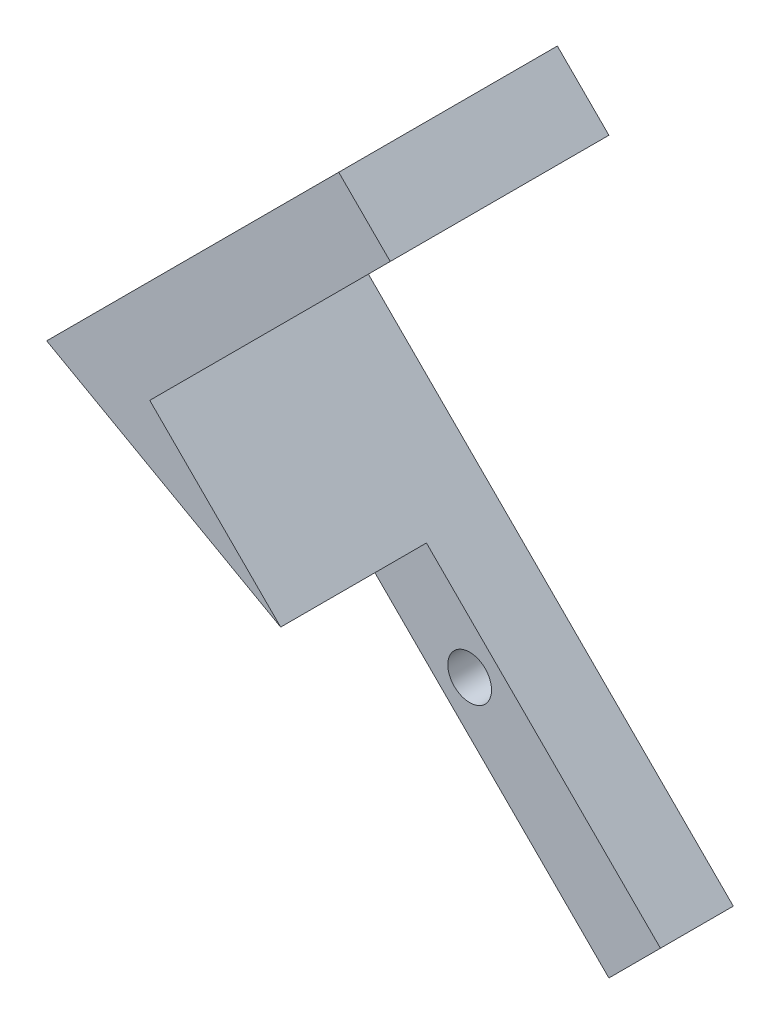
ISO-10303-21;
HEADER;
FILE_DESCRIPTION(('STEP AP214'),'2;1');
FILE_NAME('part.step','',(''),(''),'','','');
FILE_SCHEMA(('AUTOMOTIVE_DESIGN { 1 0 10303 214 1 1 1 1 }'));
ENDSEC;
DATA;
#1=APPLICATION_CONTEXT('core data for automotive mechanical design processes');
#2=APPLICATION_PROTOCOL_DEFINITION('international standard','automotive_design',2000,#1);
#3=PRODUCT_CONTEXT('',#1,'mechanical');
#4=PRODUCT('Part','Part','',(#3));
#5=PRODUCT_RELATED_PRODUCT_CATEGORY('part','',(#4));
#6=PRODUCT_DEFINITION_FORMATION('','',#4);
#7=PRODUCT_DEFINITION_CONTEXT('part definition',#1,'design');
#8=PRODUCT_DEFINITION('design','',#6,#7);
#9=PRODUCT_DEFINITION_SHAPE('','',#8);
#10=(LENGTH_UNIT() NAMED_UNIT(*) SI_UNIT(.MILLI.,.METRE.));
#11=(NAMED_UNIT(*) PLANE_ANGLE_UNIT() SI_UNIT($,.RADIAN.));
#12=(NAMED_UNIT(*) SI_UNIT($,.STERADIAN.) SOLID_ANGLE_UNIT());
#13=UNCERTAINTY_MEASURE_WITH_UNIT(LENGTH_MEASURE(1.E-05),#10,'distance_accuracy_value','');
#14=(GEOMETRIC_REPRESENTATION_CONTEXT(3) GLOBAL_UNCERTAINTY_ASSIGNED_CONTEXT((#13)) GLOBAL_UNIT_ASSIGNED_CONTEXT((#10,
#11,#12)) REPRESENTATION_CONTEXT('',''));
#15=CARTESIAN_POINT('',(0.,0.,0.));
#16=DIRECTION('',(0.,0.,1.));
#17=DIRECTION('',(1.,0.,0.));
#18=AXIS2_PLACEMENT_3D('',#15,#16,#17);
#19=CARTESIAN_POINT('',(8.53553390593255,-8.53553390593271,10.));
#20=DIRECTION('',(-0.707106781186541,0.707106781186554,0.));
#21=DIRECTION('',(-0.707106781186554,-0.707106781186541,0.));
#22=AXIS2_PLACEMENT_3D('',#19,#20,#21);
#23=PLANE('',#22);
#24=DIRECTION('',(0.707106781186554,0.707106781186541,0.));
#25=VECTOR('',#24,1.);
#26=CARTESIAN_POINT('',(8.53553390593255,-8.53553390593271,5.));
#27=LINE('',#26,#25);
#28=CARTESIAN_POINT('',(5.,-12.0710678118652,5.));
#29=VERTEX_POINT('',#28);
#30=CARTESIAN_POINT('',(8.53553390593255,-8.5355339059327,5.));
#31=VERTEX_POINT('',#30);
#32=EDGE_CURVE('E149',#29,#31,#27,.T.);
#33=ORIENTED_EDGE('',*,*,#32,.F.);
#34=DIRECTION('',(0.,0.,-1.));
#35=VECTOR('',#34,1.);
#36=CARTESIAN_POINT('',(5.,-12.0710678118652,10.));
#37=LINE('',#36,#35);
#38=CARTESIAN_POINT('',(5.,-12.0710678118652,0.));
#39=VERTEX_POINT('',#38);
#40=EDGE_CURVE('E12',#29,#39,#37,.T.);
#41=ORIENTED_EDGE('',*,*,#40,.T.);
#42=DIRECTION('',(0.707106781186554,0.707106781186541,0.));
#43=VECTOR('',#42,1.);
#44=CARTESIAN_POINT('',(8.53553390593255,-8.53553390593271,0.));
#45=LINE('',#44,#43);
#46=CARTESIAN_POINT('',(8.53553390593255,-8.5355339059327,0.));
#47=VERTEX_POINT('',#46);
#48=EDGE_CURVE('E137',#39,#47,#45,.T.);
#49=ORIENTED_EDGE('',*,*,#48,.T.);
#50=DIRECTION('',(0.,0.,-1.));
#51=VECTOR('',#50,1.);
#52=CARTESIAN_POINT('',(8.53553390593255,-8.5355339059327,10.));
#53=LINE('',#52,#51);
#54=EDGE_CURVE('E55',#31,#47,#53,.T.);
#55=ORIENTED_EDGE('',*,*,#54,.F.);
#56=EDGE_LOOP('',(#33,#41,#49,#55));
#57=FACE_BOUND('',#56,.T.);
#58=ADVANCED_FACE('F46',(#57),#23,.F.);
#59=CARTESIAN_POINT('',(-4.55056161385881,1.01502770792578,0.));
#60=DIRECTION('',(0.,0.,1.));
#61=DIRECTION('',(1.,0.,0.));
#62=AXIS2_PLACEMENT_3D('',#59,#60,#61);
#63=CYLINDRICAL_SURFACE('',#62,1.5);
#64=CARTESIAN_POINT('',(-4.55056161385881,1.01502770792578,0.));
#65=DIRECTION('',(0.,0.,1.));
#66=DIRECTION('',(1.,0.,0.));
#67=AXIS2_PLACEMENT_3D('',#64,#65,#66);
#68=CIRCLE('',#67,1.5);
#69=CARTESIAN_POINT('',(-3.05056161385881,1.01502770792578,0.));
#70=VERTEX_POINT('',#69);
#71=EDGE_CURVE('E142',#70,#70,#68,.T.);
#72=ORIENTED_EDGE('',*,*,#71,.F.);
#73=EDGE_LOOP('',(#72));
#74=FACE_BOUND('',#73,.T.);
#75=CARTESIAN_POINT('',(-4.55056161385881,1.01502770792578,5.));
#76=DIRECTION('',(0.,0.,1.));
#77=DIRECTION('',(1.,0.,0.));
#78=AXIS2_PLACEMENT_3D('',#75,#76,#77);
#79=CIRCLE('',#78,1.5);
#80=CARTESIAN_POINT('',(-3.05056161385881,1.01502770792578,5.));
#81=VERTEX_POINT('',#80);
#82=EDGE_CURVE('E153',#81,#81,#79,.F.);
#83=ORIENTED_EDGE('',*,*,#82,.F.);
#84=EDGE_LOOP('',(#83));
#85=FACE_BOUND('',#84,.T.);
#86=ADVANCED_FACE('F229',(#74,#85),#63,.F.);
#87=CARTESIAN_POINT('',(-3.53553390593268,-3.53553390593279,10.));
#88=DIRECTION('',(0.707106781186536,0.707106781186559,0.));
#89=DIRECTION('',(-0.707106781186559,0.707106781186536,0.));
#90=AXIS2_PLACEMENT_3D('',#87,#88,#89);
#91=PLANE('',#90);
#92=DIRECTION('',(0.707106781186559,-0.707106781186536,0.));
#93=VECTOR('',#92,1.);
#94=CARTESIAN_POINT('',(-3.53553390593268,-3.53553390593279,5.));
#95=LINE('',#94,#93);
#96=CARTESIAN_POINT('',(-11.0533008588992,3.98223304703362,5.));
#97=VERTEX_POINT('',#96);
#98=EDGE_CURVE('E146',#97,#29,#95,.T.);
#99=ORIENTED_EDGE('',*,*,#98,.F.);
#100=DIRECTION('',(0.,0.,-1.));
#101=VECTOR('',#100,1.);
#102=CARTESIAN_POINT('',(-11.0533008588992,3.98223304703362,5.));
#103=LINE('',#102,#101);
#104=CARTESIAN_POINT('',(-11.0533008588992,3.98223304703362,10.));
#105=VERTEX_POINT('',#104);
#106=EDGE_CURVE('E156',#105,#97,#103,.T.);
#107=ORIENTED_EDGE('',*,*,#106,.F.);
#108=DIRECTION('',(0.707106781186559,-0.707106781186536,0.));
#109=VECTOR('',#108,1.);
#110=CARTESIAN_POINT('',(-3.53553390593268,-3.53553390593279,10.));
#111=LINE('',#110,#109);
#112=CARTESIAN_POINT('',(-23.5710678118655,16.4999999999994,10.));
#113=VERTEX_POINT('',#112);
#114=EDGE_CURVE('E114',#113,#105,#111,.T.);
#115=ORIENTED_EDGE('',*,*,#114,.F.);
#116=DIRECTION('',(0.,0.,-1.));
#117=VECTOR('',#116,1.);
#118=CARTESIAN_POINT('',(-23.5710678118655,16.4999999999994,10.));
#119=LINE('',#118,#117);
#120=CARTESIAN_POINT('',(-23.5710678118655,16.4999999999994,0.));
#121=VERTEX_POINT('',#120);
#122=EDGE_CURVE('E107',#113,#121,#119,.T.);
#123=ORIENTED_EDGE('',*,*,#122,.T.);
#124=DIRECTION('',(0.707106781186559,-0.707106781186536,0.));
#125=VECTOR('',#124,1.);
#126=CARTESIAN_POINT('',(-3.53553390593268,-3.53553390593279,0.));
#127=LINE('',#126,#125);
#128=EDGE_CURVE('E113',#121,#39,#127,.T.);
#129=ORIENTED_EDGE('',*,*,#128,.T.);
#130=ORIENTED_EDGE('',*,*,#40,.F.);
#131=EDGE_LOOP('',(#99,#107,#115,#123,#129,#130));
#132=FACE_BOUND('',#131,.T.);
#133=ADVANCED_FACE('F48',(#132),#91,.F.);
#134=CARTESIAN_POINT('',(0.,0.,10.));
#135=DIRECTION('',(0.707106781186554,0.707106781186541,0.));
#136=DIRECTION('',(-0.707106781186541,0.707106781186554,0.));
#137=AXIS2_PLACEMENT_3D('',#134,#135,#136);
#138=PLANE('',#137);
#139=DIRECTION('',(0.,0.,1.));
#140=VECTOR('',#139,1.);
#141=CARTESIAN_POINT('',(-7.51776695296629,7.51776695296642,5.));
#142=LINE('',#141,#140);
#143=CARTESIAN_POINT('',(-7.51776695296629,7.51776695296642,5.));
#144=VERTEX_POINT('',#143);
#145=CARTESIAN_POINT('',(-7.51776695296629,7.51776695296642,10.));
#146=VERTEX_POINT('',#145);
#147=EDGE_CURVE('E162',#144,#146,#142,.T.);
#148=ORIENTED_EDGE('',*,*,#147,.F.);
#149=DIRECTION('',(0.707106781186541,-0.707106781186554,0.));
#150=VECTOR('',#149,1.);
#151=CARTESIAN_POINT('',(0.,0.,5.));
#152=LINE('',#151,#150);
#153=EDGE_CURVE('E134',#144,#31,#152,.T.);
#154=ORIENTED_EDGE('',*,*,#153,.T.);
#155=ORIENTED_EDGE('',*,*,#54,.T.);
#156=DIRECTION('',(0.707106781186541,-0.707106781186554,0.));
#157=VECTOR('',#156,1.);
#158=CARTESIAN_POINT('',(0.,0.,0.));
#159=LINE('',#158,#157);
#160=CARTESIAN_POINT('',(-16.4999999999997,16.5,0.));
#161=VERTEX_POINT('',#160);
#162=EDGE_CURVE('E131',#161,#47,#159,.T.);
#163=ORIENTED_EDGE('',*,*,#162,.F.);
#164=DIRECTION('',(0.,0.,-1.));
#165=VECTOR('',#164,1.);
#166=CARTESIAN_POINT('',(-16.4999999999997,16.5,10.));
#167=LINE('',#166,#165);
#168=CARTESIAN_POINT('',(-16.4999999999997,16.5,15.));
#169=VERTEX_POINT('',#168);
#170=EDGE_CURVE('E121',#169,#161,#167,.T.);
#171=ORIENTED_EDGE('',*,*,#170,.F.);
#172=DIRECTION('',(-0.707106781186541,0.707106781186554,0.));
#173=VECTOR('',#172,1.);
#174=CARTESIAN_POINT('',(-16.4999999999997,16.5,15.));
#175=LINE('',#174,#173);
#176=CARTESIAN_POINT('',(-7.51776695296629,7.51776695296642,15.));
#177=VERTEX_POINT('',#176);
#178=EDGE_CURVE('E176',#177,#169,#175,.T.);
#179=ORIENTED_EDGE('',*,*,#178,.F.);
#180=DIRECTION('',(0.,0.,-1.));
#181=VECTOR('',#180,1.);
#182=CARTESIAN_POINT('',(-7.51776695296629,7.51776695296642,15.));
#183=LINE('',#182,#181);
#184=EDGE_CURVE('E171',#177,#146,#183,.T.);
#185=ORIENTED_EDGE('',*,*,#184,.T.);
#186=EDGE_LOOP('',(#148,#154,#155,#163,#171,#179,#185));
#187=FACE_BOUND('',#186,.T.);
#188=ADVANCED_FACE('F128',(#187),#138,.T.);
#189=CARTESIAN_POINT('',(-16.5,16.4999999999997,10.));
#190=DIRECTION('',(0.707106781186554,-0.707106781186541,0.));
#191=DIRECTION('',(0.707106781186541,0.707106781186554,0.));
#192=AXIS2_PLACEMENT_3D('',#189,#190,#191);
#193=PLANE('',#192);
#194=DIRECTION('',(-0.707106781186541,-0.707106781186554,0.));
#195=VECTOR('',#194,1.);
#196=CARTESIAN_POINT('',(-16.5,16.4999999999997,0.));
#197=LINE('',#196,#195);
#198=CARTESIAN_POINT('',(0.,33.,0.));
#199=VERTEX_POINT('',#198);
#200=EDGE_CURVE('E98',#199,#161,#197,.T.);
#201=ORIENTED_EDGE('',*,*,#200,.F.);
#202=DIRECTION('',(0.,0.,-1.));
#203=VECTOR('',#202,1.);
#204=CARTESIAN_POINT('',(0.,33.,10.));
#205=LINE('',#204,#203);
#206=CARTESIAN_POINT('',(0.,33.,15.));
#207=VERTEX_POINT('',#206);
#208=EDGE_CURVE('E92',#207,#199,#205,.T.);
#209=ORIENTED_EDGE('',*,*,#208,.F.);
#210=DIRECTION('',(0.707106781186541,0.707106781186554,0.));
#211=VECTOR('',#210,1.);
#212=CARTESIAN_POINT('',(0.,33.,15.));
#213=LINE('',#212,#211);
#214=EDGE_CURVE('E182',#169,#207,#213,.T.);
#215=ORIENTED_EDGE('',*,*,#214,.F.);
#216=ORIENTED_EDGE('',*,*,#170,.T.);
#217=EDGE_LOOP('',(#201,#209,#215,#216));
#218=FACE_BOUND('',#217,.T.);
#219=ADVANCED_FACE('F238',(#218),#193,.T.);
#220=CARTESIAN_POINT('',(16.5,16.5000000000002,10.));
#221=DIRECTION('',(-0.707106781186544,-0.707106781186552,0.));
#222=DIRECTION('',(0.707106781186551,-0.707106781186544,0.));
#223=AXIS2_PLACEMENT_3D('',#220,#221,#222);
#224=PLANE('',#223);
#225=DIRECTION('',(-0.707106781186552,0.707106781186544,0.));
#226=VECTOR('',#225,1.);
#227=CARTESIAN_POINT('',(16.5,16.5000000000002,0.));
#228=LINE('',#227,#226);
#229=CARTESIAN_POINT('',(-3.53553390593267,36.5355339059326,0.));
#230=VERTEX_POINT('',#229);
#231=EDGE_CURVE('E84',#199,#230,#228,.T.);
#232=ORIENTED_EDGE('',*,*,#231,.T.);
#233=DIRECTION('',(0.,0.,-1.));
#234=VECTOR('',#233,1.);
#235=CARTESIAN_POINT('',(-3.53553390593267,36.5355339059326,10.));
#236=LINE('',#235,#234);
#237=CARTESIAN_POINT('',(-3.53553390593267,36.5355339059326,15.));
#238=VERTEX_POINT('',#237);
#239=EDGE_CURVE('E89',#238,#230,#236,.T.);
#240=ORIENTED_EDGE('',*,*,#239,.F.);
#241=DIRECTION('',(-0.707106781186552,0.707106781186543,0.));
#242=VECTOR('',#241,1.);
#243=CARTESIAN_POINT('',(-3.53553390593267,36.5355339059326,15.));
#244=LINE('',#243,#242);
#245=EDGE_CURVE('E180',#207,#238,#244,.T.);
#246=ORIENTED_EDGE('',*,*,#245,.F.);
#247=ORIENTED_EDGE('',*,*,#208,.T.);
#248=EDGE_LOOP('',(#232,#240,#246,#247));
#249=FACE_BOUND('',#248,.T.);
#250=ADVANCED_FACE('F86',(#249),#224,.F.);
#251=CARTESIAN_POINT('',(-20.0355339059327,20.0355339059322,10.));
#252=DIRECTION('',(0.707106781186555,-0.70710678118654,0.));
#253=DIRECTION('',(0.70710678118654,0.707106781186555,0.));
#254=AXIS2_PLACEMENT_3D('',#251,#252,#253);
#255=PLANE('',#254);
#256=DIRECTION('',(-0.70710678118654,-0.707106781186555,0.));
#257=VECTOR('',#256,1.);
#258=CARTESIAN_POINT('',(-20.0355339059327,20.0355339059322,0.));
#259=LINE('',#258,#257);
#260=EDGE_CURVE('E97',#230,#121,#259,.T.);
#261=ORIENTED_EDGE('',*,*,#260,.T.);
#262=ORIENTED_EDGE('',*,*,#122,.F.);
#263=DIRECTION('',(0.,0.,-1.));
#264=VECTOR('',#263,1.);
#265=CARTESIAN_POINT('',(-23.5710678118655,16.4999999999994,15.));
#266=LINE('',#265,#264);
#267=CARTESIAN_POINT('',(-23.5710678118655,16.4999999999994,15.));
#268=VERTEX_POINT('',#267);
#269=EDGE_CURVE('E168',#268,#113,#266,.T.);
#270=ORIENTED_EDGE('',*,*,#269,.F.);
#271=DIRECTION('',(-0.70710678118654,-0.707106781186555,0.));
#272=VECTOR('',#271,1.);
#273=CARTESIAN_POINT('',(-23.5710678118655,16.4999999999994,15.));
#274=LINE('',#273,#272);
#275=EDGE_CURVE('E106',#238,#268,#274,.T.);
#276=ORIENTED_EDGE('',*,*,#275,.F.);
#277=ORIENTED_EDGE('',*,*,#239,.T.);
#278=EDGE_LOOP('',(#261,#262,#270,#276,#277));
#279=FACE_BOUND('',#278,.T.);
#280=ADVANCED_FACE('F102',(#279),#255,.F.);
#281=CARTESIAN_POINT('',(0.,0.,10.));
#282=DIRECTION('',(0.,0.,1.));
#283=DIRECTION('',(1.,0.,0.));
#284=AXIS2_PLACEMENT_3D('',#281,#282,#283);
#285=PLANE('',#284);
#286=DIRECTION('',(0.872682445510569,-0.488288182631623,0.));
#287=VECTOR('',#286,1.);
#288=CARTESIAN_POINT('',(-7.51776695296629,7.51776695296642,10.));
#289=LINE('',#288,#287);
#290=EDGE_CURVE('E62',#113,#146,#289,.T.);
#291=ORIENTED_EDGE('',*,*,#290,.F.);
#292=ORIENTED_EDGE('',*,*,#114,.T.);
#293=DIRECTION('',(-0.707106781186554,-0.707106781186541,0.));
#294=VECTOR('',#293,1.);
#295=CARTESIAN_POINT('',(-7.51776695296629,7.51776695296642,10.));
#296=LINE('',#295,#294);
#297=EDGE_CURVE('E159',#146,#105,#296,.T.);
#298=ORIENTED_EDGE('',*,*,#297,.F.);
#299=EDGE_LOOP('',(#291,#292,#298));
#300=FACE_BOUND('',#299,.T.);
#301=ADVANCED_FACE('F245',(#300),#285,.T.);
#302=CARTESIAN_POINT('',(0.,0.,0.));
#303=DIRECTION('',(0.,0.,1.));
#304=DIRECTION('',(1.,0.,0.));
#305=AXIS2_PLACEMENT_3D('',#302,#303,#304);
#306=PLANE('',#305);
#307=ORIENTED_EDGE('',*,*,#71,.T.);
#308=EDGE_LOOP('',(#307));
#309=FACE_BOUND('',#308,.T.);
#310=ORIENTED_EDGE('',*,*,#128,.F.);
#311=ORIENTED_EDGE('',*,*,#260,.F.);
#312=ORIENTED_EDGE('',*,*,#231,.F.);
#313=ORIENTED_EDGE('',*,*,#200,.T.);
#314=ORIENTED_EDGE('',*,*,#162,.T.);
#315=ORIENTED_EDGE('',*,*,#48,.F.);
#316=EDGE_LOOP('',(#310,#311,#312,#313,#314,#315));
#317=FACE_BOUND('',#316,.T.);
#318=ADVANCED_FACE('F110',(#309,#317),#306,.F.);
#319=CARTESIAN_POINT('',(0.,0.,5.));
#320=DIRECTION('',(0.,0.,1.));
#321=DIRECTION('',(1.,0.,0.));
#322=AXIS2_PLACEMENT_3D('',#319,#320,#321);
#323=PLANE('',#322);
#324=ORIENTED_EDGE('',*,*,#82,.T.);
#325=EDGE_LOOP('',(#324));
#326=FACE_BOUND('',#325,.T.);
#327=ORIENTED_EDGE('',*,*,#98,.T.);
#328=ORIENTED_EDGE('',*,*,#32,.T.);
#329=ORIENTED_EDGE('',*,*,#153,.F.);
#330=DIRECTION('',(0.707106781186554,0.707106781186541,0.));
#331=VECTOR('',#330,1.);
#332=CARTESIAN_POINT('',(-7.51776695296629,7.51776695296642,5.));
#333=LINE('',#332,#331);
#334=EDGE_CURVE('E165',#97,#144,#333,.T.);
#335=ORIENTED_EDGE('',*,*,#334,.F.);
#336=EDGE_LOOP('',(#327,#328,#329,#335));
#337=FACE_BOUND('',#336,.T.);
#338=ADVANCED_FACE('F211',(#326,#337),#323,.T.);
#339=CARTESIAN_POINT('',(-7.51776695296629,7.51776695296642,0.));
#340=DIRECTION('',(-0.707106781186541,0.707106781186554,0.));
#341=DIRECTION('',(-0.707106781186554,-0.707106781186541,0.));
#342=AXIS2_PLACEMENT_3D('',#339,#340,#341);
#343=PLANE('',#342);
#344=ORIENTED_EDGE('',*,*,#334,.T.);
#345=ORIENTED_EDGE('',*,*,#147,.T.);
#346=ORIENTED_EDGE('',*,*,#297,.T.);
#347=ORIENTED_EDGE('',*,*,#106,.T.);
#348=EDGE_LOOP('',(#344,#345,#346,#347));
#349=FACE_BOUND('',#348,.T.);
#350=ADVANCED_FACE('F218',(#349),#343,.F.);
#351=CARTESIAN_POINT('',(-7.51776695296629,7.51776695296642,15.));
#352=DIRECTION('',(0.488288182631623,0.872682445510569,0.));
#353=DIRECTION('',(-0.872682445510569,0.488288182631623,0.));
#354=AXIS2_PLACEMENT_3D('',#351,#352,#353);
#355=PLANE('',#354);
#356=ORIENTED_EDGE('',*,*,#290,.T.);
#357=ORIENTED_EDGE('',*,*,#184,.F.);
#358=DIRECTION('',(0.872682445510569,-0.488288182631623,0.));
#359=VECTOR('',#358,1.);
#360=CARTESIAN_POINT('',(-7.51776695296629,7.51776695296642,15.));
#361=LINE('',#360,#359);
#362=EDGE_CURVE('E174',#268,#177,#361,.T.);
#363=ORIENTED_EDGE('',*,*,#362,.F.);
#364=ORIENTED_EDGE('',*,*,#269,.T.);
#365=EDGE_LOOP('',(#356,#357,#363,#364));
#366=FACE_BOUND('',#365,.T.);
#367=ADVANCED_FACE('F216',(#366),#355,.F.);
#368=CARTESIAN_POINT('',(0.,0.,15.));
#369=DIRECTION('',(0.,0.,1.));
#370=DIRECTION('',(1.,0.,0.));
#371=AXIS2_PLACEMENT_3D('',#368,#369,#370);
#372=PLANE('',#371);
#373=ORIENTED_EDGE('',*,*,#178,.T.);
#374=ORIENTED_EDGE('',*,*,#214,.T.);
#375=ORIENTED_EDGE('',*,*,#245,.T.);
#376=ORIENTED_EDGE('',*,*,#275,.T.);
#377=ORIENTED_EDGE('',*,*,#362,.T.);
#378=EDGE_LOOP('',(#373,#374,#375,#376,#377));
#379=FACE_BOUND('',#378,.T.);
#380=ADVANCED_FACE('F189',(#379),#372,.T.);
#381=CLOSED_SHELL('',(#58,#86,#133,#188,#219,#250,#280,#301,#318,#338,#350,#367,#380));
#382=MANIFOLD_SOLID_BREP('B2',#381);
#383=ADVANCED_BREP_SHAPE_REPRESENTATION('',(#18,#382),#14);
#384=SHAPE_DEFINITION_REPRESENTATION(#9,#383);
ENDSEC;
END-ISO-10303-21;
